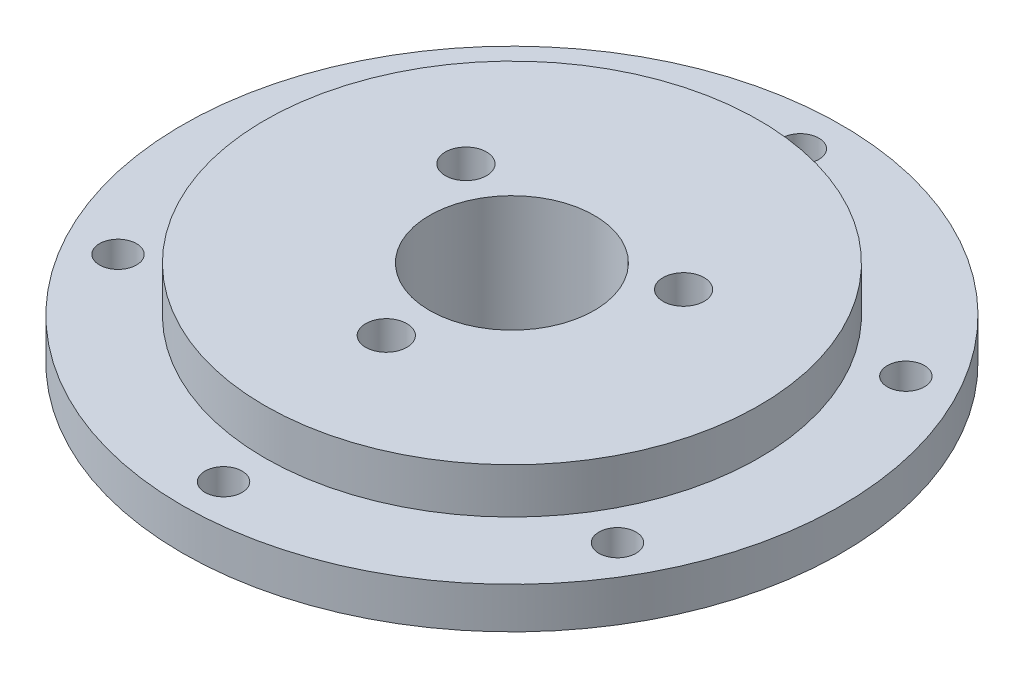
ISO-10303-21;
HEADER;
FILE_DESCRIPTION(('STEP AP214'),'2;1');
FILE_NAME('part.step','',(''),(''),'','','');
FILE_SCHEMA(('AUTOMOTIVE_DESIGN { 1 0 10303 214 1 1 1 1 }'));
ENDSEC;
DATA;
#1=APPLICATION_CONTEXT('core data for automotive mechanical design processes');
#2=APPLICATION_PROTOCOL_DEFINITION('international standard','automotive_design',2000,#1);
#3=PRODUCT_CONTEXT('',#1,'mechanical');
#4=PRODUCT('Part','Part','',(#3));
#5=PRODUCT_RELATED_PRODUCT_CATEGORY('part','',(#4));
#6=PRODUCT_DEFINITION_FORMATION('','',#4);
#7=PRODUCT_DEFINITION_CONTEXT('part definition',#1,'design');
#8=PRODUCT_DEFINITION('design','',#6,#7);
#9=PRODUCT_DEFINITION_SHAPE('','',#8);
#10=(LENGTH_UNIT() NAMED_UNIT(*) SI_UNIT(.MILLI.,.METRE.));
#11=(NAMED_UNIT(*) PLANE_ANGLE_UNIT() SI_UNIT($,.RADIAN.));
#12=(NAMED_UNIT(*) SI_UNIT($,.STERADIAN.) SOLID_ANGLE_UNIT());
#13=UNCERTAINTY_MEASURE_WITH_UNIT(LENGTH_MEASURE(1.E-05),#10,'distance_accuracy_value','');
#14=(GEOMETRIC_REPRESENTATION_CONTEXT(3) GLOBAL_UNCERTAINTY_ASSIGNED_CONTEXT((#13)) GLOBAL_UNIT_ASSIGNED_CONTEXT((#10,
#11,#12)) REPRESENTATION_CONTEXT('',''));
#15=CARTESIAN_POINT('',(0.,0.,0.));
#16=DIRECTION('',(0.,0.,1.));
#17=DIRECTION('',(1.,0.,0.));
#18=AXIS2_PLACEMENT_3D('',#15,#16,#17);
#19=CARTESIAN_POINT('',(0.,5.,0.));
#20=DIRECTION('',(0.,1.,0.));
#21=DIRECTION('',(0.,0.,1.));
#22=AXIS2_PLACEMENT_3D('',#19,#20,#21);
#23=PLANE('',#22);
#24=CARTESIAN_POINT('',(0.,5.,0.));
#25=DIRECTION('',(0.,1.,0.));
#26=DIRECTION('',(0.,0.,1.));
#27=AXIS2_PLACEMENT_3D('',#24,#25,#26);
#28=CIRCLE('',#27,30.);
#29=CARTESIAN_POINT('',(0.,5.,30.));
#30=VERTEX_POINT('',#29);
#31=EDGE_CURVE('E11',#30,#30,#28,.T.);
#32=ORIENTED_EDGE('',*,*,#31,.F.);
#33=EDGE_LOOP('',(#32));
#34=FACE_BOUND('',#33,.T.);
#35=CARTESIAN_POINT('',(-30.3108891324555,5.,17.4999999999997));
#36=DIRECTION('',(0.,1.,0.));
#37=DIRECTION('',(0.,0.,1.));
#38=AXIS2_PLACEMENT_3D('',#35,#36,#37);
#39=CIRCLE('',#38,2.25);
#40=CARTESIAN_POINT('',(-30.3108891324555,5.,19.7499999999997));
#41=VERTEX_POINT('',#40);
#42=EDGE_CURVE('E59',#41,#41,#39,.T.);
#43=ORIENTED_EDGE('',*,*,#42,.F.);
#44=EDGE_LOOP('',(#43));
#45=FACE_BOUND('',#44,.T.);
#46=CARTESIAN_POINT('',(30.3108891324553,5.,17.5000000000001));
#47=DIRECTION('',(0.,1.,0.));
#48=DIRECTION('',(0.,0.,1.));
#49=AXIS2_PLACEMENT_3D('',#46,#47,#48);
#50=CIRCLE('',#49,2.25);
#51=CARTESIAN_POINT('',(30.3108891324553,5.,19.7500000000001));
#52=VERTEX_POINT('',#51);
#53=EDGE_CURVE('E71',#52,#52,#50,.T.);
#54=ORIENTED_EDGE('',*,*,#53,.F.);
#55=EDGE_LOOP('',(#54));
#56=FACE_BOUND('',#55,.T.);
#57=CARTESIAN_POINT('',(0.,5.,-35.));
#58=DIRECTION('',(0.,1.,0.));
#59=DIRECTION('',(0.,0.,1.));
#60=AXIS2_PLACEMENT_3D('',#57,#58,#59);
#61=CIRCLE('',#60,2.25);
#62=CARTESIAN_POINT('',(0.,5.,-32.75));
#63=VERTEX_POINT('',#62);
#64=EDGE_CURVE('E83',#63,#63,#61,.T.);
#65=ORIENTED_EDGE('',*,*,#64,.F.);
#66=EDGE_LOOP('',(#65));
#67=FACE_BOUND('',#66,.T.);
#68=CARTESIAN_POINT('',(0.,5.,0.));
#69=DIRECTION('',(0.,1.,0.));
#70=DIRECTION('',(0.,0.,1.));
#71=AXIS2_PLACEMENT_3D('',#68,#69,#70);
#72=CIRCLE('',#71,40.);
#73=CARTESIAN_POINT('',(0.,5.,40.));
#74=VERTEX_POINT('',#73);
#75=EDGE_CURVE('E41',#74,#74,#72,.T.);
#76=ORIENTED_EDGE('',*,*,#75,.T.);
#77=EDGE_LOOP('',(#76));
#78=FACE_BOUND('',#77,.T.);
#79=CARTESIAN_POINT('',(30.3108891324554,5.,-17.4999999999999));
#80=DIRECTION('',(0.,1.,0.));
#81=DIRECTION('',(0.,0.,1.));
#82=AXIS2_PLACEMENT_3D('',#79,#80,#81);
#83=CIRCLE('',#82,2.25);
#84=CARTESIAN_POINT('',(30.3108891324554,5.,-15.2499999999999));
#85=VERTEX_POINT('',#84);
#86=EDGE_CURVE('E77',#85,#85,#83,.T.);
#87=ORIENTED_EDGE('',*,*,#86,.F.);
#88=EDGE_LOOP('',(#87));
#89=FACE_BOUND('',#88,.T.);
#90=CARTESIAN_POINT('',(-2.44403693719019E-13,5.,35.));
#91=DIRECTION('',(0.,1.,0.));
#92=DIRECTION('',(0.,0.,1.));
#93=AXIS2_PLACEMENT_3D('',#90,#91,#92);
#94=CIRCLE('',#93,2.25);
#95=CARTESIAN_POINT('',(-2.44403693719019E-13,5.,37.25));
#96=VERTEX_POINT('',#95);
#97=EDGE_CURVE('E65',#96,#96,#94,.T.);
#98=ORIENTED_EDGE('',*,*,#97,.F.);
#99=EDGE_LOOP('',(#98));
#100=FACE_BOUND('',#99,.T.);
#101=CARTESIAN_POINT('',(-30.3108891324552,5.,-17.5000000000004));
#102=DIRECTION('',(0.,1.,0.));
#103=DIRECTION('',(0.,0.,1.));
#104=AXIS2_PLACEMENT_3D('',#101,#102,#103);
#105=CIRCLE('',#104,2.25);
#106=CARTESIAN_POINT('',(-30.3108891324552,5.,-15.2500000000004));
#107=VERTEX_POINT('',#106);
#108=EDGE_CURVE('E52',#107,#107,#105,.T.);
#109=ORIENTED_EDGE('',*,*,#108,.F.);
#110=EDGE_LOOP('',(#109));
#111=FACE_BOUND('',#110,.T.);
#112=ADVANCED_FACE('F33',(#34,#45,#56,#67,#78,#89,#100,#111),#23,.T.);
#113=CARTESIAN_POINT('',(0.,0.,0.));
#114=DIRECTION('',(0.,1.,0.));
#115=DIRECTION('',(0.,0.,1.));
#116=AXIS2_PLACEMENT_3D('',#113,#114,#115);
#117=PLANE('',#116);
#118=CARTESIAN_POINT('',(0.,0.,0.));
#119=DIRECTION('',(0.,1.,0.));
#120=DIRECTION('',(0.,0.,1.));
#121=AXIS2_PLACEMENT_3D('',#118,#119,#120);
#122=CIRCLE('',#121,30.);
#123=CARTESIAN_POINT('',(0.,0.,30.));
#124=VERTEX_POINT('',#123);
#125=EDGE_CURVE('E37',#124,#124,#122,.T.);
#126=ORIENTED_EDGE('',*,*,#125,.T.);
#127=EDGE_LOOP('',(#126));
#128=FACE_BOUND('',#127,.T.);
#129=CARTESIAN_POINT('',(0.,0.,0.));
#130=DIRECTION('',(0.,1.,0.));
#131=DIRECTION('',(0.,0.,1.));
#132=AXIS2_PLACEMENT_3D('',#129,#130,#131);
#133=CIRCLE('',#132,40.);
#134=CARTESIAN_POINT('',(0.,0.,40.));
#135=VERTEX_POINT('',#134);
#136=EDGE_CURVE('E46',#135,#135,#133,.T.);
#137=ORIENTED_EDGE('',*,*,#136,.F.);
#138=EDGE_LOOP('',(#137));
#139=FACE_BOUND('',#138,.T.);
#140=CARTESIAN_POINT('',(0.,0.,-35.));
#141=DIRECTION('',(0.,1.,0.));
#142=DIRECTION('',(0.,0.,1.));
#143=AXIS2_PLACEMENT_3D('',#140,#141,#142);
#144=CIRCLE('',#143,2.25);
#145=CARTESIAN_POINT('',(0.,0.,-32.75));
#146=VERTEX_POINT('',#145);
#147=EDGE_CURVE('E80',#146,#146,#144,.T.);
#148=ORIENTED_EDGE('',*,*,#147,.T.);
#149=EDGE_LOOP('',(#148));
#150=FACE_BOUND('',#149,.T.);
#151=CARTESIAN_POINT('',(30.3108891324554,0.,-17.4999999999999));
#152=DIRECTION('',(0.,1.,0.));
#153=DIRECTION('',(0.,0.,1.));
#154=AXIS2_PLACEMENT_3D('',#151,#152,#153);
#155=CIRCLE('',#154,2.25);
#156=CARTESIAN_POINT('',(30.3108891324554,0.,-15.2499999999999));
#157=VERTEX_POINT('',#156);
#158=EDGE_CURVE('E74',#157,#157,#155,.T.);
#159=ORIENTED_EDGE('',*,*,#158,.T.);
#160=EDGE_LOOP('',(#159));
#161=FACE_BOUND('',#160,.T.);
#162=CARTESIAN_POINT('',(30.3108891324553,0.,17.5000000000001));
#163=DIRECTION('',(0.,1.,0.));
#164=DIRECTION('',(0.,0.,1.));
#165=AXIS2_PLACEMENT_3D('',#162,#163,#164);
#166=CIRCLE('',#165,2.25);
#167=CARTESIAN_POINT('',(30.3108891324553,0.,19.7500000000001));
#168=VERTEX_POINT('',#167);
#169=EDGE_CURVE('E68',#168,#168,#166,.T.);
#170=ORIENTED_EDGE('',*,*,#169,.T.);
#171=EDGE_LOOP('',(#170));
#172=FACE_BOUND('',#171,.T.);
#173=CARTESIAN_POINT('',(-2.44403693719019E-13,0.,35.));
#174=DIRECTION('',(0.,1.,0.));
#175=DIRECTION('',(0.,0.,1.));
#176=AXIS2_PLACEMENT_3D('',#173,#174,#175);
#177=CIRCLE('',#176,2.25);
#178=CARTESIAN_POINT('',(-2.44403693719019E-13,0.,37.25));
#179=VERTEX_POINT('',#178);
#180=EDGE_CURVE('E62',#179,#179,#177,.T.);
#181=ORIENTED_EDGE('',*,*,#180,.T.);
#182=EDGE_LOOP('',(#181));
#183=FACE_BOUND('',#182,.T.);
#184=CARTESIAN_POINT('',(-30.3108891324555,0.,17.4999999999997));
#185=DIRECTION('',(0.,1.,0.));
#186=DIRECTION('',(0.,0.,1.));
#187=AXIS2_PLACEMENT_3D('',#184,#185,#186);
#188=CIRCLE('',#187,2.25);
#189=CARTESIAN_POINT('',(-30.3108891324555,0.,19.7499999999997));
#190=VERTEX_POINT('',#189);
#191=EDGE_CURVE('E55',#190,#190,#188,.T.);
#192=ORIENTED_EDGE('',*,*,#191,.T.);
#193=EDGE_LOOP('',(#192));
#194=FACE_BOUND('',#193,.T.);
#195=CARTESIAN_POINT('',(-30.3108891324552,0.,-17.5000000000004));
#196=DIRECTION('',(0.,1.,0.));
#197=DIRECTION('',(0.,0.,1.));
#198=AXIS2_PLACEMENT_3D('',#195,#196,#197);
#199=CIRCLE('',#198,2.25);
#200=CARTESIAN_POINT('',(-30.3108891324552,0.,-15.2500000000004));
#201=VERTEX_POINT('',#200);
#202=EDGE_CURVE('E56',#201,#201,#199,.T.);
#203=ORIENTED_EDGE('',*,*,#202,.T.);
#204=EDGE_LOOP('',(#203));
#205=FACE_BOUND('',#204,.T.);
#206=ADVANCED_FACE('F91',(#128,#139,#150,#161,#172,#183,#194,#205),#117,.F.);
#207=CARTESIAN_POINT('',(0.,5.,0.));
#208=DIRECTION('',(0.,-1.,0.));
#209=DIRECTION('',(0.,0.,-1.));
#210=AXIS2_PLACEMENT_3D('',#207,#208,#209);
#211=CYLINDRICAL_SURFACE('',#210,40.);
#212=ORIENTED_EDGE('',*,*,#75,.F.);
#213=EDGE_LOOP('',(#212));
#214=FACE_BOUND('',#213,.T.);
#215=ORIENTED_EDGE('',*,*,#136,.T.);
#216=EDGE_LOOP('',(#215));
#217=FACE_BOUND('',#216,.T.);
#218=ADVANCED_FACE('F35',(#214,#217),#211,.T.);
#219=CARTESIAN_POINT('',(0.,5.,-35.));
#220=DIRECTION('',(0.,-1.,0.));
#221=DIRECTION('',(0.,0.,-1.));
#222=AXIS2_PLACEMENT_3D('',#219,#220,#221);
#223=CYLINDRICAL_SURFACE('',#222,2.25);
#224=ORIENTED_EDGE('',*,*,#64,.T.);
#225=EDGE_LOOP('',(#224));
#226=FACE_BOUND('',#225,.T.);
#227=ORIENTED_EDGE('',*,*,#147,.F.);
#228=EDGE_LOOP('',(#227));
#229=FACE_BOUND('',#228,.T.);
#230=ADVANCED_FACE('F131',(#226,#229),#223,.F.);
#231=CARTESIAN_POINT('',(30.3108891324554,5.,-17.4999999999999));
#232=DIRECTION('',(0.,-1.,0.));
#233=DIRECTION('',(0.,0.,-1.));
#234=AXIS2_PLACEMENT_3D('',#231,#232,#233);
#235=CYLINDRICAL_SURFACE('',#234,2.25);
#236=ORIENTED_EDGE('',*,*,#86,.T.);
#237=EDGE_LOOP('',(#236));
#238=FACE_BOUND('',#237,.T.);
#239=ORIENTED_EDGE('',*,*,#158,.F.);
#240=EDGE_LOOP('',(#239));
#241=FACE_BOUND('',#240,.T.);
#242=ADVANCED_FACE('F134',(#238,#241),#235,.F.);
#243=CARTESIAN_POINT('',(30.3108891324553,5.,17.5000000000001));
#244=DIRECTION('',(0.,-1.,0.));
#245=DIRECTION('',(0.,0.,-1.));
#246=AXIS2_PLACEMENT_3D('',#243,#244,#245);
#247=CYLINDRICAL_SURFACE('',#246,2.25);
#248=ORIENTED_EDGE('',*,*,#53,.T.);
#249=EDGE_LOOP('',(#248));
#250=FACE_BOUND('',#249,.T.);
#251=ORIENTED_EDGE('',*,*,#169,.F.);
#252=EDGE_LOOP('',(#251));
#253=FACE_BOUND('',#252,.T.);
#254=ADVANCED_FACE('F138',(#250,#253),#247,.F.);
#255=CARTESIAN_POINT('',(-2.44403693719019E-13,5.,35.));
#256=DIRECTION('',(0.,-1.,0.));
#257=DIRECTION('',(0.,0.,-1.));
#258=AXIS2_PLACEMENT_3D('',#255,#256,#257);
#259=CYLINDRICAL_SURFACE('',#258,2.25);
#260=ORIENTED_EDGE('',*,*,#97,.T.);
#261=EDGE_LOOP('',(#260));
#262=FACE_BOUND('',#261,.T.);
#263=ORIENTED_EDGE('',*,*,#180,.F.);
#264=EDGE_LOOP('',(#263));
#265=FACE_BOUND('',#264,.T.);
#266=ADVANCED_FACE('F120',(#262,#265),#259,.F.);
#267=CARTESIAN_POINT('',(-30.3108891324555,5.,17.4999999999997));
#268=DIRECTION('',(0.,-1.,0.));
#269=DIRECTION('',(0.,0.,-1.));
#270=AXIS2_PLACEMENT_3D('',#267,#268,#269);
#271=CYLINDRICAL_SURFACE('',#270,2.25);
#272=ORIENTED_EDGE('',*,*,#42,.T.);
#273=EDGE_LOOP('',(#272));
#274=FACE_BOUND('',#273,.T.);
#275=ORIENTED_EDGE('',*,*,#191,.F.);
#276=EDGE_LOOP('',(#275));
#277=FACE_BOUND('',#276,.T.);
#278=ADVANCED_FACE('F110',(#274,#277),#271,.F.);
#279=CARTESIAN_POINT('',(-30.3108891324552,5.,-17.5000000000004));
#280=DIRECTION('',(0.,-1.,0.));
#281=DIRECTION('',(0.,0.,-1.));
#282=AXIS2_PLACEMENT_3D('',#279,#280,#281);
#283=CYLINDRICAL_SURFACE('',#282,2.25);
#284=ORIENTED_EDGE('',*,*,#108,.T.);
#285=EDGE_LOOP('',(#284));
#286=FACE_BOUND('',#285,.T.);
#287=ORIENTED_EDGE('',*,*,#202,.F.);
#288=EDGE_LOOP('',(#287));
#289=FACE_BOUND('',#288,.T.);
#290=ADVANCED_FACE('F107',(#286,#289),#283,.F.);
#291=CARTESIAN_POINT('',(0.,-95.8528137423857,0.));
#292=DIRECTION('',(0.,1.,0.));
#293=DIRECTION('',(0.,0.,1.));
#294=AXIS2_PLACEMENT_3D('',#291,#292,#293);
#295=CYLINDRICAL_SURFACE('',#294,10.);
#296=CARTESIAN_POINT('',(0.,-5.50000000000001,0.));
#297=DIRECTION('',(0.,1.,0.));
#298=DIRECTION('',(0.,0.,1.));
#299=AXIS2_PLACEMENT_3D('',#296,#297,#298);
#300=CIRCLE('',#299,10.);
#301=CARTESIAN_POINT('',(0.,-5.50000000000001,10.));
#302=VERTEX_POINT('',#301);
#303=EDGE_CURVE('E281',#302,#302,#300,.F.);
#304=ORIENTED_EDGE('',*,*,#303,.T.);
#305=EDGE_LOOP('',(#304));
#306=FACE_BOUND('',#305,.T.);
#307=CARTESIAN_POINT('',(0.,10.5,0.));
#308=DIRECTION('',(0.,1.,0.));
#309=DIRECTION('',(0.,0.,1.));
#310=AXIS2_PLACEMENT_3D('',#307,#308,#309);
#311=CIRCLE('',#310,10.);
#312=CARTESIAN_POINT('',(0.,10.5,10.));
#313=VERTEX_POINT('',#312);
#314=EDGE_CURVE('E271',#313,#313,#311,.T.);
#315=ORIENTED_EDGE('',*,*,#314,.T.);
#316=EDGE_LOOP('',(#315));
#317=FACE_BOUND('',#316,.T.);
#318=ADVANCED_FACE('F109',(#306,#317),#295,.F.);
#319=CARTESIAN_POINT('',(-13.2068874077127,-95.8528137423857,-7.625));
#320=DIRECTION('',(0.,1.,0.));
#321=DIRECTION('',(0.,0.,1.));
#322=AXIS2_PLACEMENT_3D('',#319,#320,#321);
#323=CYLINDRICAL_SURFACE('',#322,2.5);
#324=CARTESIAN_POINT('',(-13.2068874077127,-5.50000000000001,-7.625));
#325=DIRECTION('',(0.,1.,0.));
#326=DIRECTION('',(0.,0.,1.));
#327=AXIS2_PLACEMENT_3D('',#324,#325,#326);
#328=CIRCLE('',#327,2.5);
#329=CARTESIAN_POINT('',(-13.2068874077127,-5.50000000000001,-5.125));
#330=VERTEX_POINT('',#329);
#331=EDGE_CURVE('E278',#330,#330,#328,.F.);
#332=ORIENTED_EDGE('',*,*,#331,.T.);
#333=EDGE_LOOP('',(#332));
#334=FACE_BOUND('',#333,.T.);
#335=CARTESIAN_POINT('',(-13.2068874077127,10.5,-7.625));
#336=DIRECTION('',(0.,1.,0.));
#337=DIRECTION('',(0.,0.,1.));
#338=AXIS2_PLACEMENT_3D('',#335,#336,#337);
#339=CIRCLE('',#338,2.5);
#340=CARTESIAN_POINT('',(-13.2068874077127,10.5,-5.125));
#341=VERTEX_POINT('',#340);
#342=EDGE_CURVE('E263',#341,#341,#339,.T.);
#343=ORIENTED_EDGE('',*,*,#342,.T.);
#344=EDGE_LOOP('',(#343));
#345=FACE_BOUND('',#344,.T.);
#346=ADVANCED_FACE('F117',(#334,#345),#323,.F.);
#347=CARTESIAN_POINT('',(0.,-95.8528137423857,15.25));
#348=DIRECTION('',(0.,1.,0.));
#349=DIRECTION('',(0.,0.,1.));
#350=AXIS2_PLACEMENT_3D('',#347,#348,#349);
#351=CYLINDRICAL_SURFACE('',#350,2.5);
#352=CARTESIAN_POINT('',(0.,-5.50000000000001,15.25));
#353=DIRECTION('',(0.,1.,0.));
#354=DIRECTION('',(0.,0.,1.));
#355=AXIS2_PLACEMENT_3D('',#352,#353,#354);
#356=CIRCLE('',#355,2.5);
#357=CARTESIAN_POINT('',(0.,-5.50000000000001,17.75));
#358=VERTEX_POINT('',#357);
#359=EDGE_CURVE('E282',#358,#358,#356,.F.);
#360=ORIENTED_EDGE('',*,*,#359,.T.);
#361=EDGE_LOOP('',(#360));
#362=FACE_BOUND('',#361,.T.);
#363=CARTESIAN_POINT('',(0.,10.5,15.25));
#364=DIRECTION('',(0.,1.,0.));
#365=DIRECTION('',(0.,0.,1.));
#366=AXIS2_PLACEMENT_3D('',#363,#364,#365);
#367=CIRCLE('',#366,2.5);
#368=CARTESIAN_POINT('',(0.,10.5,17.75));
#369=VERTEX_POINT('',#368);
#370=EDGE_CURVE('E266',#369,#369,#367,.T.);
#371=ORIENTED_EDGE('',*,*,#370,.T.);
#372=EDGE_LOOP('',(#371));
#373=FACE_BOUND('',#372,.T.);
#374=ADVANCED_FACE('F186',(#362,#373),#351,.F.);
#375=CARTESIAN_POINT('',(0.,-95.8528137423857,0.));
#376=DIRECTION('',(0.,1.,0.));
#377=DIRECTION('',(0.,0.,1.));
#378=AXIS2_PLACEMENT_3D('',#375,#376,#377);
#379=CYLINDRICAL_SURFACE('',#378,30.);
#380=CARTESIAN_POINT('',(0.,-5.50000000000001,0.));
#381=DIRECTION('',(0.,1.,0.));
#382=DIRECTION('',(0.,0.,1.));
#383=AXIS2_PLACEMENT_3D('',#380,#381,#382);
#384=CIRCLE('',#383,30.);
#385=CARTESIAN_POINT('',(0.,-5.50000000000001,30.));
#386=VERTEX_POINT('',#385);
#387=EDGE_CURVE('E277',#386,#386,#384,.F.);
#388=ORIENTED_EDGE('',*,*,#387,.F.);
#389=EDGE_LOOP('',(#388));
#390=FACE_BOUND('',#389,.T.);
#391=ORIENTED_EDGE('',*,*,#125,.F.);
#392=EDGE_LOOP('',(#391));
#393=FACE_BOUND('',#392,.T.);
#394=ADVANCED_FACE('F180',(#390,#393),#379,.T.);
#395=CARTESIAN_POINT('',(0.,-5.5,0.));
#396=DIRECTION('',(0.,1.,0.));
#397=DIRECTION('',(0.,0.,1.));
#398=AXIS2_PLACEMENT_3D('',#395,#396,#397);
#399=PLANE('',#398);
#400=ORIENTED_EDGE('',*,*,#387,.T.);
#401=EDGE_LOOP('',(#400));
#402=FACE_BOUND('',#401,.T.);
#403=ORIENTED_EDGE('',*,*,#359,.F.);
#404=EDGE_LOOP('',(#403));
#405=FACE_BOUND('',#404,.T.);
#406=CARTESIAN_POINT('',(13.2068874077127,-5.50000000000001,-7.62500000000001));
#407=DIRECTION('',(0.,1.,0.));
#408=DIRECTION('',(0.,0.,1.));
#409=AXIS2_PLACEMENT_3D('',#406,#407,#408);
#410=CIRCLE('',#409,2.5);
#411=CARTESIAN_POINT('',(13.2068874077127,-5.50000000000001,-5.125));
#412=VERTEX_POINT('',#411);
#413=EDGE_CURVE('E50',#412,#412,#410,.F.);
#414=ORIENTED_EDGE('',*,*,#413,.F.);
#415=EDGE_LOOP('',(#414));
#416=FACE_BOUND('',#415,.T.);
#417=ORIENTED_EDGE('',*,*,#331,.F.);
#418=EDGE_LOOP('',(#417));
#419=FACE_BOUND('',#418,.T.);
#420=ORIENTED_EDGE('',*,*,#303,.F.);
#421=EDGE_LOOP('',(#420));
#422=FACE_BOUND('',#421,.T.);
#423=ADVANCED_FACE('F185',(#402,#405,#416,#419,#422),#399,.F.);
#424=CARTESIAN_POINT('',(13.2068874077127,-95.8528137423857,-7.62500000000001));
#425=DIRECTION('',(0.,1.,0.));
#426=DIRECTION('',(0.,0.,1.));
#427=AXIS2_PLACEMENT_3D('',#424,#425,#426);
#428=CYLINDRICAL_SURFACE('',#427,2.5);
#429=ORIENTED_EDGE('',*,*,#413,.T.);
#430=EDGE_LOOP('',(#429));
#431=FACE_BOUND('',#430,.T.);
#432=CARTESIAN_POINT('',(13.2068874077127,10.5,-7.62500000000001));
#433=DIRECTION('',(0.,1.,0.));
#434=DIRECTION('',(0.,0.,1.));
#435=AXIS2_PLACEMENT_3D('',#432,#433,#434);
#436=CIRCLE('',#435,2.5);
#437=CARTESIAN_POINT('',(13.2068874077127,10.5,-5.125));
#438=VERTEX_POINT('',#437);
#439=EDGE_CURVE('E261',#438,#438,#436,.T.);
#440=ORIENTED_EDGE('',*,*,#439,.T.);
#441=EDGE_LOOP('',(#440));
#442=FACE_BOUND('',#441,.T.);
#443=ADVANCED_FACE('F198',(#431,#442),#428,.F.);
#444=ORIENTED_EDGE('',*,*,#31,.T.);
#445=EDGE_LOOP('',(#444));
#446=FACE_BOUND('',#445,.T.);
#447=CARTESIAN_POINT('',(0.,10.5,0.));
#448=DIRECTION('',(0.,1.,0.));
#449=DIRECTION('',(0.,0.,1.));
#450=AXIS2_PLACEMENT_3D('',#447,#448,#449);
#451=CIRCLE('',#450,30.);
#452=CARTESIAN_POINT('',(0.,10.5,30.));
#453=VERTEX_POINT('',#452);
#454=EDGE_CURVE('E274',#453,#453,#451,.T.);
#455=ORIENTED_EDGE('',*,*,#454,.F.);
#456=EDGE_LOOP('',(#455));
#457=FACE_BOUND('',#456,.T.);
#458=ADVANCED_FACE('F188',(#446,#457),#379,.T.);
#459=CARTESIAN_POINT('',(0.,10.5,0.));
#460=DIRECTION('',(0.,1.,0.));
#461=DIRECTION('',(0.,0.,1.));
#462=AXIS2_PLACEMENT_3D('',#459,#460,#461);
#463=PLANE('',#462);
#464=ORIENTED_EDGE('',*,*,#342,.F.);
#465=EDGE_LOOP('',(#464));
#466=FACE_BOUND('',#465,.T.);
#467=ORIENTED_EDGE('',*,*,#314,.F.);
#468=EDGE_LOOP('',(#467));
#469=FACE_BOUND('',#468,.T.);
#470=ORIENTED_EDGE('',*,*,#454,.T.);
#471=EDGE_LOOP('',(#470));
#472=FACE_BOUND('',#471,.T.);
#473=ORIENTED_EDGE('',*,*,#370,.F.);
#474=EDGE_LOOP('',(#473));
#475=FACE_BOUND('',#474,.T.);
#476=ORIENTED_EDGE('',*,*,#439,.F.);
#477=EDGE_LOOP('',(#476));
#478=FACE_BOUND('',#477,.T.);
#479=ADVANCED_FACE('F210',(#466,#469,#472,#475,#478),#463,.T.);
#480=CLOSED_SHELL('',(#112,#206,#218,#230,#242,#254,#266,#278,#290,#318,#346,#374,#394,#423,
#443,#458,#479));
#481=MANIFOLD_SOLID_BREP('B2',#480);
#482=ADVANCED_BREP_SHAPE_REPRESENTATION('',(#18,#481),#14);
#483=SHAPE_DEFINITION_REPRESENTATION(#9,#482);
ENDSEC;
END-ISO-10303-21;
